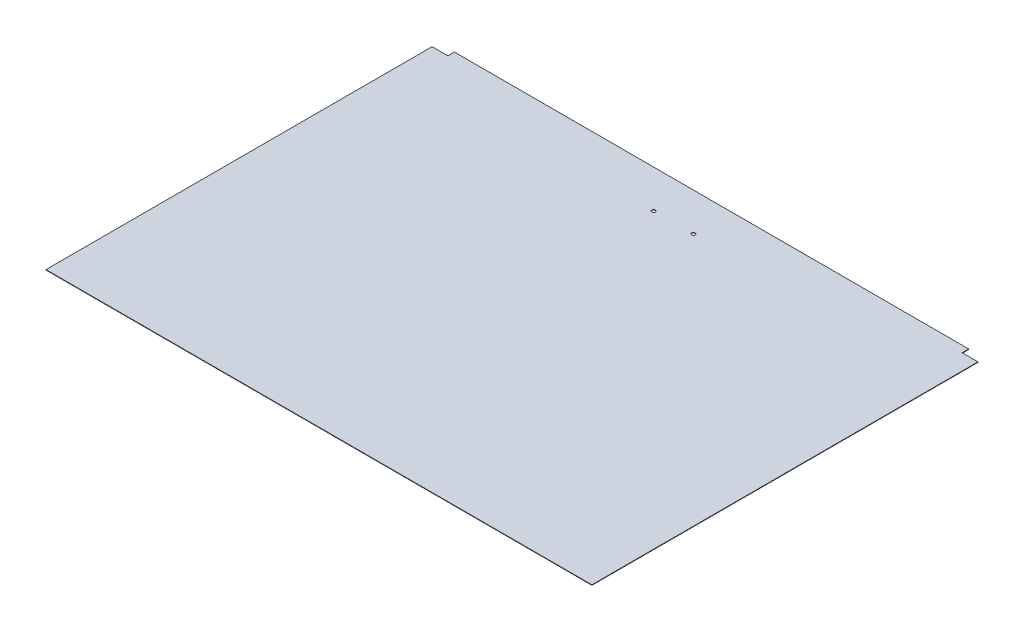
ISO-10303-21;
HEADER;
FILE_DESCRIPTION(('STEP AP214'),'2;1');
FILE_NAME('part.step','',(''),(''),'','','');
FILE_SCHEMA(('AUTOMOTIVE_DESIGN { 1 0 10303 214 1 1 1 1 }'));
ENDSEC;
DATA;
#1=APPLICATION_CONTEXT('core data for automotive mechanical design processes');
#2=APPLICATION_PROTOCOL_DEFINITION('international standard','automotive_design',2000,#1);
#3=PRODUCT_CONTEXT('',#1,'mechanical');
#4=PRODUCT('Part','Part','',(#3));
#5=PRODUCT_RELATED_PRODUCT_CATEGORY('part','',(#4));
#6=PRODUCT_DEFINITION_FORMATION('','',#4);
#7=PRODUCT_DEFINITION_CONTEXT('part definition',#1,'design');
#8=PRODUCT_DEFINITION('design','',#6,#7);
#9=PRODUCT_DEFINITION_SHAPE('','',#8);
#10=(LENGTH_UNIT() NAMED_UNIT(*) SI_UNIT(.MILLI.,.METRE.));
#11=(NAMED_UNIT(*) PLANE_ANGLE_UNIT() SI_UNIT($,.RADIAN.));
#12=(NAMED_UNIT(*) SI_UNIT($,.STERADIAN.) SOLID_ANGLE_UNIT());
#13=UNCERTAINTY_MEASURE_WITH_UNIT(LENGTH_MEASURE(1.E-05),#10,'distance_accuracy_value','');
#14=(GEOMETRIC_REPRESENTATION_CONTEXT(3) GLOBAL_UNCERTAINTY_ASSIGNED_CONTEXT((#13)) GLOBAL_UNIT_ASSIGNED_CONTEXT((#10,
#11,#12)) REPRESENTATION_CONTEXT('',''));
#15=CARTESIAN_POINT('',(0.,0.,0.));
#16=DIRECTION('',(0.,0.,1.));
#17=DIRECTION('',(1.,0.,0.));
#18=AXIS2_PLACEMENT_3D('',#15,#16,#17);
#19=CARTESIAN_POINT('',(0.,0.,-710.));
#20=DIRECTION('',(0.,0.,-1.));
#21=DIRECTION('',(-1.,0.,0.));
#22=AXIS2_PLACEMENT_3D('',#19,#20,#21);
#23=PLANE('',#22);
#24=DIRECTION('',(-1.,0.,0.));
#25=VECTOR('',#24,1.);
#26=CARTESIAN_POINT('',(0.,0.88,-710.));
#27=LINE('',#26,#25);
#28=CARTESIAN_POINT('',(992.949291584567,0.879999999999945,-710.));
#29=VERTEX_POINT('',#28);
#30=CARTESIAN_POINT('',(963.9,0.88,-710.));
#31=VERTEX_POINT('',#30);
#32=EDGE_CURVE('E64',#29,#31,#27,.T.);
#33=ORIENTED_EDGE('',*,*,#32,.F.);
#34=DIRECTION('',(0.,-1.,0.));
#35=VECTOR('',#34,1.);
#36=CARTESIAN_POINT('',(992.949291584567,0.,-710.));
#37=LINE('',#36,#35);
#38=CARTESIAN_POINT('',(992.949291584567,0.,-710.));
#39=VERTEX_POINT('',#38);
#40=EDGE_CURVE('E149',#29,#39,#37,.T.);
#41=ORIENTED_EDGE('',*,*,#40,.T.);
#42=DIRECTION('',(-1.,0.,0.));
#43=VECTOR('',#42,1.);
#44=CARTESIAN_POINT('',(0.,0.,-710.));
#45=LINE('',#44,#43);
#46=CARTESIAN_POINT('',(963.9,0.,-710.));
#47=VERTEX_POINT('',#46);
#48=EDGE_CURVE('E56',#39,#47,#45,.T.);
#49=ORIENTED_EDGE('',*,*,#48,.T.);
#50=DIRECTION('',(0.,1.,0.));
#51=VECTOR('',#50,1.);
#52=CARTESIAN_POINT('',(963.9,0.,-710.));
#53=LINE('',#52,#51);
#54=EDGE_CURVE('E179',#47,#31,#53,.T.);
#55=ORIENTED_EDGE('',*,*,#54,.T.);
#56=EDGE_LOOP('',(#33,#41,#49,#55));
#57=FACE_BOUND('',#56,.T.);
#58=ADVANCED_FACE('F41',(#57),#23,.T.);
#59=CARTESIAN_POINT('',(18.,0.,0.));
#60=DIRECTION('',(-1.,0.,0.));
#61=DIRECTION('',(0.,0.,1.));
#62=AXIS2_PLACEMENT_3D('',#59,#60,#61);
#63=PLANE('',#62);
#64=DIRECTION('',(0.,0.,1.));
#65=VECTOR('',#64,1.);
#66=CARTESIAN_POINT('',(18.,0.88,0.));
#67=LINE('',#66,#65);
#68=CARTESIAN_POINT('',(18.,0.879999999999934,-721.999380400259));
#69=VERTEX_POINT('',#68);
#70=CARTESIAN_POINT('',(18.,0.88,-710.));
#71=VERTEX_POINT('',#70);
#72=EDGE_CURVE('E123',#69,#71,#67,.T.);
#73=ORIENTED_EDGE('',*,*,#72,.F.);
#74=DIRECTION('',(0.,-1.,0.));
#75=VECTOR('',#74,1.);
#76=CARTESIAN_POINT('',(18.,0.,-721.999380400259));
#77=LINE('',#76,#75);
#78=CARTESIAN_POINT('',(18.,0.,-721.999380400259));
#79=VERTEX_POINT('',#78);
#80=EDGE_CURVE('E120',#69,#79,#77,.T.);
#81=ORIENTED_EDGE('',*,*,#80,.T.);
#82=DIRECTION('',(0.,0.,1.));
#83=VECTOR('',#82,1.);
#84=CARTESIAN_POINT('',(18.,0.,0.));
#85=LINE('',#84,#83);
#86=CARTESIAN_POINT('',(18.,0.,-710.));
#87=VERTEX_POINT('',#86);
#88=EDGE_CURVE('E106',#79,#87,#85,.T.);
#89=ORIENTED_EDGE('',*,*,#88,.T.);
#90=DIRECTION('',(0.,1.,0.));
#91=VECTOR('',#90,1.);
#92=CARTESIAN_POINT('',(18.,0.,-710.));
#93=LINE('',#92,#91);
#94=EDGE_CURVE('E171',#87,#71,#93,.T.);
#95=ORIENTED_EDGE('',*,*,#94,.T.);
#96=EDGE_LOOP('',(#73,#81,#89,#95));
#97=FACE_BOUND('',#96,.T.);
#98=ADVANCED_FACE('F121',(#97),#63,.T.);
#99=CARTESIAN_POINT('',(0.,0.88,-722.));
#100=DIRECTION('',(0.,-1.,0.));
#101=DIRECTION('',(0.,0.,-1.));
#102=AXIS2_PLACEMENT_3D('',#99,#100,#101);
#103=PLANE('',#102);
#104=CARTESIAN_POINT('',(527.5,0.88,-652.));
#105=DIRECTION('',(0.,1.,0.));
#106=DIRECTION('',(0.,0.,-1.));
#107=AXIS2_PLACEMENT_3D('',#104,#105,#106);
#108=CIRCLE('',#107,3.24999999999994);
#109=CARTESIAN_POINT('',(527.5,0.88,-655.25));
#110=VERTEX_POINT('',#109);
#111=EDGE_CURVE('E151',#110,#110,#108,.T.);
#112=ORIENTED_EDGE('',*,*,#111,.F.);
#113=EDGE_LOOP('',(#112));
#114=FACE_BOUND('',#113,.T.);
#115=CARTESIAN_POINT('',(454.4,0.88,-652.));
#116=DIRECTION('',(0.,1.,0.));
#117=DIRECTION('',(0.,0.,1.));
#118=AXIS2_PLACEMENT_3D('',#115,#116,#117);
#119=CIRCLE('',#118,3.24999999999994);
#120=CARTESIAN_POINT('',(454.4,0.88,-648.75));
#121=VERTEX_POINT('',#120);
#122=EDGE_CURVE('E162',#121,#121,#119,.T.);
#123=ORIENTED_EDGE('',*,*,#122,.F.);
#124=EDGE_LOOP('',(#123));
#125=FACE_BOUND('',#124,.T.);
#126=DIRECTION('',(1.,0.,0.));
#127=VECTOR('',#126,1.);
#128=CARTESIAN_POINT('',(0.,0.88,0.));
#129=LINE('',#128,#127);
#130=CARTESIAN_POINT('',(-11.0492915845668,0.880000000000055,0.));
#131=VERTEX_POINT('',#130);
#132=CARTESIAN_POINT('',(992.949291584567,0.879999999999945,0.));
#133=VERTEX_POINT('',#132);
#134=EDGE_CURVE('E12',#131,#133,#129,.T.);
#135=ORIENTED_EDGE('',*,*,#134,.T.);
#136=DIRECTION('',(0.,0.,1.));
#137=VECTOR('',#136,1.);
#138=CARTESIAN_POINT('',(992.949291584567,0.879999999999945,-355.));
#139=LINE('',#138,#137);
#140=EDGE_CURVE('E152',#133,#29,#139,.F.);
#141=ORIENTED_EDGE('',*,*,#140,.T.);
#142=ORIENTED_EDGE('',*,*,#32,.T.);
#143=DIRECTION('',(0.,0.,1.));
#144=VECTOR('',#143,1.);
#145=CARTESIAN_POINT('',(963.9,0.88,0.));
#146=LINE('',#145,#144);
#147=CARTESIAN_POINT('',(963.9,0.879999999999934,-721.999380400259));
#148=VERTEX_POINT('',#147);
#149=EDGE_CURVE('E177',#148,#31,#146,.T.);
#150=ORIENTED_EDGE('',*,*,#149,.F.);
#151=DIRECTION('',(1.,0.,0.));
#152=VECTOR('',#151,1.);
#153=CARTESIAN_POINT('',(490.95,0.879999999999934,-721.999380400259));
#154=LINE('',#153,#152);
#155=EDGE_CURVE('E128',#148,#69,#154,.F.);
#156=ORIENTED_EDGE('',*,*,#155,.T.);
#157=ORIENTED_EDGE('',*,*,#72,.T.);
#158=DIRECTION('',(1.,0.,0.));
#159=VECTOR('',#158,1.);
#160=CARTESIAN_POINT('',(0.,0.88,-710.));
#161=LINE('',#160,#159);
#162=CARTESIAN_POINT('',(-11.0492915845668,0.880000000000055,-710.));
#163=VERTEX_POINT('',#162);
#164=EDGE_CURVE('E117',#163,#71,#161,.T.);
#165=ORIENTED_EDGE('',*,*,#164,.F.);
#166=DIRECTION('',(0.,0.,-1.));
#167=VECTOR('',#166,1.);
#168=CARTESIAN_POINT('',(-11.0492915845668,0.880000000000055,-355.));
#169=LINE('',#168,#167);
#170=EDGE_CURVE('E144',#131,#163,#169,.T.);
#171=ORIENTED_EDGE('',*,*,#170,.F.);
#172=EDGE_LOOP('',(#135,#141,#142,#150,#156,#157,#165,#171));
#173=FACE_BOUND('',#172,.T.);
#174=ADVANCED_FACE('F43',(#114,#125,#173),#103,.F.);
#175=CARTESIAN_POINT('',(0.,0.,-722.));
#176=DIRECTION('',(0.,-1.,0.));
#177=DIRECTION('',(0.,0.,-1.));
#178=AXIS2_PLACEMENT_3D('',#175,#176,#177);
#179=PLANE('',#178);
#180=ORIENTED_EDGE('',*,*,#48,.F.);
#181=DIRECTION('',(0.,0.,-1.));
#182=VECTOR('',#181,1.);
#183=CARTESIAN_POINT('',(992.949291584567,0.,-355.));
#184=LINE('',#183,#182);
#185=CARTESIAN_POINT('',(992.949291584567,0.,0.));
#186=VERTEX_POINT('',#185);
#187=EDGE_CURVE('E154',#186,#39,#184,.T.);
#188=ORIENTED_EDGE('',*,*,#187,.F.);
#189=DIRECTION('',(1.,0.,0.));
#190=VECTOR('',#189,1.);
#191=CARTESIAN_POINT('',(0.,0.,0.));
#192=LINE('',#191,#190);
#193=CARTESIAN_POINT('',(-11.0492915845668,0.,0.));
#194=VERTEX_POINT('',#193);
#195=EDGE_CURVE('E45',#194,#186,#192,.T.);
#196=ORIENTED_EDGE('',*,*,#195,.F.);
#197=DIRECTION('',(0.,0.,-1.));
#198=VECTOR('',#197,1.);
#199=CARTESIAN_POINT('',(-11.0492915845668,0.,-355.));
#200=LINE('',#199,#198);
#201=CARTESIAN_POINT('',(-11.0492915845668,0.,-710.));
#202=VERTEX_POINT('',#201);
#203=EDGE_CURVE('E138',#194,#202,#200,.T.);
#204=ORIENTED_EDGE('',*,*,#203,.T.);
#205=DIRECTION('',(1.,0.,0.));
#206=VECTOR('',#205,1.);
#207=CARTESIAN_POINT('',(0.,0.,-710.));
#208=LINE('',#207,#206);
#209=EDGE_CURVE('E113',#202,#87,#208,.T.);
#210=ORIENTED_EDGE('',*,*,#209,.T.);
#211=ORIENTED_EDGE('',*,*,#88,.F.);
#212=DIRECTION('',(-1.,0.,0.));
#213=VECTOR('',#212,1.);
#214=CARTESIAN_POINT('',(490.95,0.,-721.999380400259));
#215=LINE('',#214,#213);
#216=CARTESIAN_POINT('',(963.9,0.,-721.999380400259));
#217=VERTEX_POINT('',#216);
#218=EDGE_CURVE('E111',#217,#79,#215,.T.);
#219=ORIENTED_EDGE('',*,*,#218,.F.);
#220=DIRECTION('',(0.,0.,1.));
#221=VECTOR('',#220,1.);
#222=CARTESIAN_POINT('',(963.9,0.,0.));
#223=LINE('',#222,#221);
#224=EDGE_CURVE('E176',#217,#47,#223,.T.);
#225=ORIENTED_EDGE('',*,*,#224,.T.);
#226=EDGE_LOOP('',(#180,#188,#196,#204,#210,#211,#219,#225));
#227=FACE_BOUND('',#226,.T.);
#228=CARTESIAN_POINT('',(527.5,0.,-652.));
#229=DIRECTION('',(0.,1.,0.));
#230=DIRECTION('',(0.,0.,-1.));
#231=AXIS2_PLACEMENT_3D('',#228,#229,#230);
#232=CIRCLE('',#231,3.24999999999994);
#233=CARTESIAN_POINT('',(527.5,0.,-655.25));
#234=VERTEX_POINT('',#233);
#235=EDGE_CURVE('E159',#234,#234,#232,.T.);
#236=ORIENTED_EDGE('',*,*,#235,.T.);
#237=EDGE_LOOP('',(#236));
#238=FACE_BOUND('',#237,.T.);
#239=CARTESIAN_POINT('',(454.4,0.,-652.));
#240=DIRECTION('',(0.,1.,0.));
#241=DIRECTION('',(0.,0.,1.));
#242=AXIS2_PLACEMENT_3D('',#239,#240,#241);
#243=CIRCLE('',#242,3.24999999999994);
#244=CARTESIAN_POINT('',(454.4,0.,-648.75));
#245=VERTEX_POINT('',#244);
#246=EDGE_CURVE('E165',#245,#245,#243,.T.);
#247=ORIENTED_EDGE('',*,*,#246,.T.);
#248=EDGE_LOOP('',(#247));
#249=FACE_BOUND('',#248,.T.);
#250=ADVANCED_FACE('F108',(#227,#238,#249),#179,.T.);
#251=CARTESIAN_POINT('',(0.,0.88,0.));
#252=DIRECTION('',(0.,0.,-1.));
#253=DIRECTION('',(-1.,0.,0.));
#254=AXIS2_PLACEMENT_3D('',#251,#252,#253);
#255=PLANE('',#254);
#256=ORIENTED_EDGE('',*,*,#195,.T.);
#257=DIRECTION('',(0.,-1.,0.));
#258=VECTOR('',#257,1.);
#259=CARTESIAN_POINT('',(992.949291584567,0.,0.));
#260=LINE('',#259,#258);
#261=EDGE_CURVE('E140',#133,#186,#260,.T.);
#262=ORIENTED_EDGE('',*,*,#261,.F.);
#263=ORIENTED_EDGE('',*,*,#134,.F.);
#264=DIRECTION('',(0.,1.,0.));
#265=VECTOR('',#264,1.);
#266=CARTESIAN_POINT('',(-11.0492915845668,0.880000000000055,0.));
#267=LINE('',#266,#265);
#268=EDGE_CURVE('E127',#194,#131,#267,.T.);
#269=ORIENTED_EDGE('',*,*,#268,.F.);
#270=EDGE_LOOP('',(#256,#262,#263,#269));
#271=FACE_BOUND('',#270,.T.);
#272=ADVANCED_FACE('F186',(#271),#255,.F.);
#273=CARTESIAN_POINT('',(963.9,0.,0.));
#274=DIRECTION('',(-1.,0.,0.));
#275=DIRECTION('',(0.,0.,1.));
#276=AXIS2_PLACEMENT_3D('',#273,#274,#275);
#277=PLANE('',#276);
#278=ORIENTED_EDGE('',*,*,#224,.F.);
#279=DIRECTION('',(0.,-1.,0.));
#280=VECTOR('',#279,1.);
#281=CARTESIAN_POINT('',(963.9,0.,-721.999380400259));
#282=LINE('',#281,#280);
#283=EDGE_CURVE('E133',#148,#217,#282,.T.);
#284=ORIENTED_EDGE('',*,*,#283,.F.);
#285=ORIENTED_EDGE('',*,*,#149,.T.);
#286=ORIENTED_EDGE('',*,*,#54,.F.);
#287=EDGE_LOOP('',(#278,#284,#285,#286));
#288=FACE_BOUND('',#287,.T.);
#289=ADVANCED_FACE('F200',(#288),#277,.F.);
#290=CARTESIAN_POINT('',(0.,0.,-710.));
#291=DIRECTION('',(0.,0.,1.));
#292=DIRECTION('',(1.,0.,0.));
#293=AXIS2_PLACEMENT_3D('',#290,#291,#292);
#294=PLANE('',#293);
#295=ORIENTED_EDGE('',*,*,#209,.F.);
#296=DIRECTION('',(0.,1.,0.));
#297=VECTOR('',#296,1.);
#298=CARTESIAN_POINT('',(-11.0492915845668,0.880000000000055,-710.));
#299=LINE('',#298,#297);
#300=EDGE_CURVE('E141',#202,#163,#299,.T.);
#301=ORIENTED_EDGE('',*,*,#300,.T.);
#302=ORIENTED_EDGE('',*,*,#164,.T.);
#303=ORIENTED_EDGE('',*,*,#94,.F.);
#304=EDGE_LOOP('',(#295,#301,#302,#303));
#305=FACE_BOUND('',#304,.T.);
#306=ADVANCED_FACE('F198',(#305),#294,.F.);
#307=CARTESIAN_POINT('',(454.4,0.,-652.));
#308=DIRECTION('',(0.,1.,0.));
#309=DIRECTION('',(0.,0.,1.));
#310=AXIS2_PLACEMENT_3D('',#307,#308,#309);
#311=CYLINDRICAL_SURFACE('',#310,3.24999999999994);
#312=ORIENTED_EDGE('',*,*,#246,.F.);
#313=EDGE_LOOP('',(#312));
#314=FACE_BOUND('',#313,.T.);
#315=ORIENTED_EDGE('',*,*,#122,.T.);
#316=EDGE_LOOP('',(#315));
#317=FACE_BOUND('',#316,.T.);
#318=ADVANCED_FACE('F207',(#314,#317),#311,.F.);
#319=CARTESIAN_POINT('',(527.5,0.,-652.));
#320=DIRECTION('',(0.,1.,0.));
#321=DIRECTION('',(0.,0.,1.));
#322=AXIS2_PLACEMENT_3D('',#319,#320,#321);
#323=CYLINDRICAL_SURFACE('',#322,3.24999999999994);
#324=ORIENTED_EDGE('',*,*,#235,.F.);
#325=EDGE_LOOP('',(#324));
#326=FACE_BOUND('',#325,.T.);
#327=ORIENTED_EDGE('',*,*,#111,.T.);
#328=EDGE_LOOP('',(#327));
#329=FACE_BOUND('',#328,.T.);
#330=ADVANCED_FACE('F228',(#326,#329),#323,.F.);
#331=CARTESIAN_POINT('',(992.949291584567,0.,-355.));
#332=DIRECTION('',(-1.,0.,0.));
#333=DIRECTION('',(0.,0.,-1.));
#334=AXIS2_PLACEMENT_3D('',#331,#332,#333);
#335=PLANE('',#334);
#336=ORIENTED_EDGE('',*,*,#40,.F.);
#337=ORIENTED_EDGE('',*,*,#140,.F.);
#338=ORIENTED_EDGE('',*,*,#261,.T.);
#339=ORIENTED_EDGE('',*,*,#187,.T.);
#340=EDGE_LOOP('',(#336,#337,#338,#339));
#341=FACE_BOUND('',#340,.T.);
#342=ADVANCED_FACE('F192',(#341),#335,.F.);
#343=CARTESIAN_POINT('',(-11.0492915845668,0.880000000000055,-355.));
#344=DIRECTION('',(1.,0.,0.));
#345=DIRECTION('',(0.,0.,-1.));
#346=AXIS2_PLACEMENT_3D('',#343,#344,#345);
#347=PLANE('',#346);
#348=ORIENTED_EDGE('',*,*,#300,.F.);
#349=ORIENTED_EDGE('',*,*,#203,.F.);
#350=ORIENTED_EDGE('',*,*,#268,.T.);
#351=ORIENTED_EDGE('',*,*,#170,.T.);
#352=EDGE_LOOP('',(#348,#349,#350,#351));
#353=FACE_BOUND('',#352,.T.);
#354=ADVANCED_FACE('F196',(#353),#347,.F.);
#355=CARTESIAN_POINT('',(490.95,0.,-721.999380400259));
#356=DIRECTION('',(0.,0.,1.));
#357=DIRECTION('',(-1.,0.,0.));
#358=AXIS2_PLACEMENT_3D('',#355,#356,#357);
#359=PLANE('',#358);
#360=ORIENTED_EDGE('',*,*,#80,.F.);
#361=ORIENTED_EDGE('',*,*,#155,.F.);
#362=ORIENTED_EDGE('',*,*,#283,.T.);
#363=ORIENTED_EDGE('',*,*,#218,.T.);
#364=EDGE_LOOP('',(#360,#361,#362,#363));
#365=FACE_BOUND('',#364,.T.);
#366=ADVANCED_FACE('F131',(#365),#359,.F.);
#367=CLOSED_SHELL('',(#58,#98,#174,#250,#272,#289,#306,#318,#330,#342,#354,#366));
#368=MANIFOLD_SOLID_BREP('B2',#367);
#369=ADVANCED_BREP_SHAPE_REPRESENTATION('',(#18,#368),#14);
#370=SHAPE_DEFINITION_REPRESENTATION(#9,#369);
ENDSEC;
END-ISO-10303-21;
